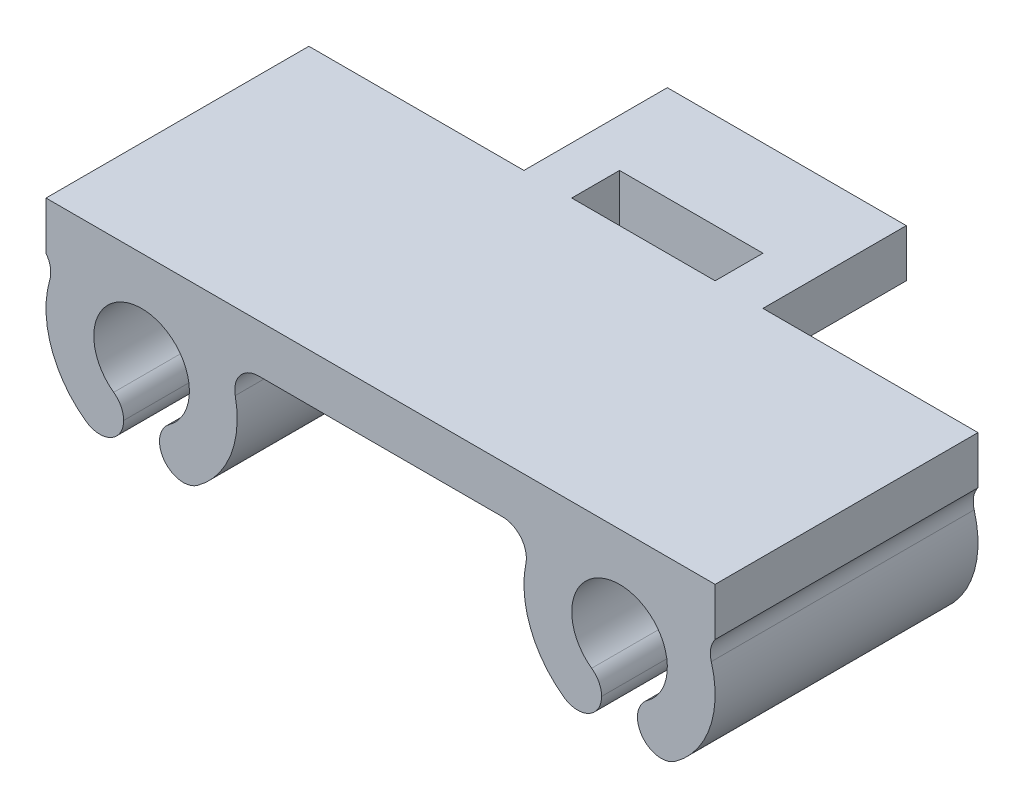
ISO-10303-21;
HEADER;
FILE_DESCRIPTION(('STEP AP214'),'2;1');
FILE_NAME('part.step','',(''),(''),'','','');
FILE_SCHEMA(('AUTOMOTIVE_DESIGN { 1 0 10303 214 1 1 1 1 }'));
ENDSEC;
DATA;
#1=APPLICATION_CONTEXT('core data for automotive mechanical design processes');
#2=APPLICATION_PROTOCOL_DEFINITION('international standard','automotive_design',2000,#1);
#3=PRODUCT_CONTEXT('',#1,'mechanical');
#4=PRODUCT('Part','Part','',(#3));
#5=PRODUCT_RELATED_PRODUCT_CATEGORY('part','',(#4));
#6=PRODUCT_DEFINITION_FORMATION('','',#4);
#7=PRODUCT_DEFINITION_CONTEXT('part definition',#1,'design');
#8=PRODUCT_DEFINITION('design','',#6,#7);
#9=PRODUCT_DEFINITION_SHAPE('','',#8);
#10=(LENGTH_UNIT() NAMED_UNIT(*) SI_UNIT(.MILLI.,.METRE.));
#11=(NAMED_UNIT(*) PLANE_ANGLE_UNIT() SI_UNIT($,.RADIAN.));
#12=(NAMED_UNIT(*) SI_UNIT($,.STERADIAN.) SOLID_ANGLE_UNIT());
#13=UNCERTAINTY_MEASURE_WITH_UNIT(LENGTH_MEASURE(1.E-05),#10,'distance_accuracy_value','');
#14=(GEOMETRIC_REPRESENTATION_CONTEXT(3) GLOBAL_UNCERTAINTY_ASSIGNED_CONTEXT((#13)) GLOBAL_UNIT_ASSIGNED_CONTEXT((#10,
#11,#12)) REPRESENTATION_CONTEXT('',''));
#15=CARTESIAN_POINT('',(0.,0.,0.));
#16=DIRECTION('',(0.,0.,1.));
#17=DIRECTION('',(1.,0.,0.));
#18=AXIS2_PLACEMENT_3D('',#15,#16,#17);
#19=CARTESIAN_POINT('',(0.,0.,0.));
#20=DIRECTION('',(0.,1.,0.));
#21=DIRECTION('',(0.,0.,1.));
#22=AXIS2_PLACEMENT_3D('',#19,#20,#21);
#23=PLANE('',#22);
#24=DIRECTION('',(1.,0.,0.));
#25=VECTOR('',#24,1.);
#26=CARTESIAN_POINT('',(0.,0.,-5.5));
#27=LINE('',#26,#25);
#28=CARTESIAN_POINT('',(-3.,0.,-5.5));
#29=VERTEX_POINT('',#28);
#30=CARTESIAN_POINT('',(3.,0.,-5.5));
#31=VERTEX_POINT('',#30);
#32=EDGE_CURVE('E240',#29,#31,#27,.T.);
#33=ORIENTED_EDGE('',*,*,#32,.T.);
#34=DIRECTION('',(0.,0.,1.));
#35=VECTOR('',#34,1.);
#36=CARTESIAN_POINT('',(3.00000000000001,0.,0.));
#37=LINE('',#36,#35);
#38=CARTESIAN_POINT('',(3.,0.,-7.5));
#39=VERTEX_POINT('',#38);
#40=EDGE_CURVE('E293',#39,#31,#37,.T.);
#41=ORIENTED_EDGE('',*,*,#40,.F.);
#42=DIRECTION('',(1.,0.,0.));
#43=VECTOR('',#42,1.);
#44=CARTESIAN_POINT('',(0.,0.,-7.5));
#45=LINE('',#44,#43);
#46=CARTESIAN_POINT('',(-3.,0.,-7.5));
#47=VERTEX_POINT('',#46);
#48=EDGE_CURVE('E291',#47,#39,#45,.T.);
#49=ORIENTED_EDGE('',*,*,#48,.F.);
#50=DIRECTION('',(0.,0.,1.));
#51=VECTOR('',#50,1.);
#52=CARTESIAN_POINT('',(-2.99999999999999,0.,0.));
#53=LINE('',#52,#51);
#54=EDGE_CURVE('E286',#47,#29,#53,.T.);
#55=ORIENTED_EDGE('',*,*,#54,.T.);
#56=EDGE_LOOP('',(#33,#41,#49,#55));
#57=FACE_BOUND('',#56,.T.);
#58=DIRECTION('',(1.,0.,0.));
#59=VECTOR('',#58,1.);
#60=CARTESIAN_POINT('',(0.,0.,5.5));
#61=LINE('',#60,#59);
#62=CARTESIAN_POINT('',(-5.10102051443364,0.,5.5));
#63=VERTEX_POINT('',#62);
#64=CARTESIAN_POINT('',(5.10102051443364,0.,5.5));
#65=VERTEX_POINT('',#64);
#66=EDGE_CURVE('E296',#63,#65,#61,.T.);
#67=ORIENTED_EDGE('',*,*,#66,.F.);
#68=DIRECTION('',(0.,0.,1.));
#69=VECTOR('',#68,1.);
#70=CARTESIAN_POINT('',(-5.10102051443364,0.,-5.5));
#71=LINE('',#70,#69);
#72=CARTESIAN_POINT('',(-5.10102051443364,0.,-5.5));
#73=VERTEX_POINT('',#72);
#74=EDGE_CURVE('E354',#63,#73,#71,.F.);
#75=ORIENTED_EDGE('',*,*,#74,.T.);
#76=CARTESIAN_POINT('',(-5.,0.,-5.5));
#77=VERTEX_POINT('',#76);
#78=EDGE_CURVE('E288',#73,#77,#27,.T.);
#79=ORIENTED_EDGE('',*,*,#78,.T.);
#80=DIRECTION('',(0.,0.,1.));
#81=VECTOR('',#80,1.);
#82=CARTESIAN_POINT('',(-5.,0.,0.));
#83=LINE('',#82,#81);
#84=CARTESIAN_POINT('',(-5.,0.,-11.5));
#85=VERTEX_POINT('',#84);
#86=EDGE_CURVE('E308',#85,#77,#83,.T.);
#87=ORIENTED_EDGE('',*,*,#86,.F.);
#88=DIRECTION('',(1.,0.,0.));
#89=VECTOR('',#88,1.);
#90=CARTESIAN_POINT('',(0.,0.,-11.5));
#91=LINE('',#90,#89);
#92=CARTESIAN_POINT('',(5.,0.,-11.5));
#93=VERTEX_POINT('',#92);
#94=EDGE_CURVE('E305',#85,#93,#91,.T.);
#95=ORIENTED_EDGE('',*,*,#94,.T.);
#96=DIRECTION('',(0.,0.,1.));
#97=VECTOR('',#96,1.);
#98=CARTESIAN_POINT('',(5.,0.,0.));
#99=LINE('',#98,#97);
#100=CARTESIAN_POINT('',(5.,0.,-5.5));
#101=VERTEX_POINT('',#100);
#102=EDGE_CURVE('E302',#93,#101,#99,.T.);
#103=ORIENTED_EDGE('',*,*,#102,.T.);
#104=CARTESIAN_POINT('',(5.10102051443364,0.,-5.5));
#105=VERTEX_POINT('',#104);
#106=EDGE_CURVE('E289',#101,#105,#27,.T.);
#107=ORIENTED_EDGE('',*,*,#106,.T.);
#108=DIRECTION('',(0.,0.,1.));
#109=VECTOR('',#108,1.);
#110=CARTESIAN_POINT('',(5.10102051443364,0.,5.5));
#111=LINE('',#110,#109);
#112=EDGE_CURVE('E352',#105,#65,#111,.T.);
#113=ORIENTED_EDGE('',*,*,#112,.T.);
#114=EDGE_LOOP('',(#67,#75,#79,#87,#95,#103,#107,#113));
#115=FACE_BOUND('',#114,.T.);
#116=ADVANCED_FACE('F38',(#57,#115),#23,.F.);
#117=CARTESIAN_POINT('',(0.,2.,5.5));
#118=DIRECTION('',(0.,0.,-1.));
#119=DIRECTION('',(-1.,0.,0.));
#120=AXIS2_PLACEMENT_3D('',#117,#118,#119);
#121=PLANE('',#120);
#122=CARTESIAN_POINT('',(11.75,-4.43669858620224,5.5));
#123=DIRECTION('',(0.,0.,-1.));
#124=DIRECTION('',(-1.,0.,0.));
#125=AXIS2_PLACEMENT_3D('',#122,#123,#124);
#126=CIRCLE('',#125,1.);
#127=CARTESIAN_POINT('',(11.1666666666667,-3.62446572413482,5.5));
#128=VERTEX_POINT('',#127);
#129=CARTESIAN_POINT('',(10.75,-4.43669858620224,5.5));
#130=VERTEX_POINT('',#129);
#131=EDGE_CURVE('E382',#128,#130,#126,.F.);
#132=ORIENTED_EDGE('',*,*,#131,.T.);
#133=CARTESIAN_POINT('',(11.75,-4.43669858620224,5.5));
#134=DIRECTION('',(0.,0.,-1.));
#135=DIRECTION('',(-1.,0.,0.));
#136=AXIS2_PLACEMENT_3D('',#133,#134,#135);
#137=CIRCLE('',#136,1.);
#138=CARTESIAN_POINT('',(12.3333333333333,-5.24893144826965,5.5));
#139=VERTEX_POINT('',#138);
#140=EDGE_CURVE('E384',#130,#139,#137,.F.);
#141=ORIENTED_EDGE('',*,*,#140,.T.);
#142=CARTESIAN_POINT('',(10.,-2.,5.5));
#143=DIRECTION('',(0.,0.,1.));
#144=DIRECTION('',(-1.,0.,0.));
#145=AXIS2_PLACEMENT_3D('',#142,#143,#144);
#146=CIRCLE('',#145,4.);
#147=CARTESIAN_POINT('',(13.84,-0.88,5.5));
#148=VERTEX_POINT('',#147);
#149=EDGE_CURVE('E449',#139,#148,#146,.T.);
#150=ORIENTED_EDGE('',*,*,#149,.T.);
#151=CARTESIAN_POINT('',(14.8,-0.600000000000001,5.5));
#152=DIRECTION('',(0.,0.,-1.));
#153=DIRECTION('',(-1.,0.,0.));
#154=AXIS2_PLACEMENT_3D('',#151,#152,#153);
#155=CIRCLE('',#154,1.);
#156=CARTESIAN_POINT('',(14.,0.,5.5));
#157=VERTEX_POINT('',#156);
#158=EDGE_CURVE('E406',#148,#157,#155,.T.);
#159=ORIENTED_EDGE('',*,*,#158,.T.);
#160=DIRECTION('',(0.,-1.,0.));
#161=VECTOR('',#160,1.);
#162=CARTESIAN_POINT('',(14.,2.,5.5));
#163=LINE('',#162,#161);
#164=CARTESIAN_POINT('',(14.,2.,5.5));
#165=VERTEX_POINT('',#164);
#166=EDGE_CURVE('E328',#165,#157,#163,.T.);
#167=ORIENTED_EDGE('',*,*,#166,.F.);
#168=DIRECTION('',(1.,0.,0.));
#169=VECTOR('',#168,1.);
#170=CARTESIAN_POINT('',(0.,2.,5.5));
#171=LINE('',#170,#169);
#172=CARTESIAN_POINT('',(-14.,2.,5.5));
#173=VERTEX_POINT('',#172);
#174=EDGE_CURVE('E267',#173,#165,#171,.T.);
#175=ORIENTED_EDGE('',*,*,#174,.F.);
#176=DIRECTION('',(0.,-1.,0.));
#177=VECTOR('',#176,1.);
#178=CARTESIAN_POINT('',(-14.,2.,5.5));
#179=LINE('',#178,#177);
#180=CARTESIAN_POINT('',(-14.,0.,5.5));
#181=VERTEX_POINT('',#180);
#182=EDGE_CURVE('E245',#173,#181,#179,.T.);
#183=ORIENTED_EDGE('',*,*,#182,.T.);
#184=CARTESIAN_POINT('',(-14.8,-0.599999999999994,5.5));
#185=DIRECTION('',(0.,0.,-1.));
#186=DIRECTION('',(-1.,0.,0.));
#187=AXIS2_PLACEMENT_3D('',#184,#185,#186);
#188=CIRCLE('',#187,1.);
#189=CARTESIAN_POINT('',(-13.84,-0.879999999999996,5.5));
#190=VERTEX_POINT('',#189);
#191=EDGE_CURVE('E404',#181,#190,#188,.T.);
#192=ORIENTED_EDGE('',*,*,#191,.T.);
#193=CARTESIAN_POINT('',(-10.,-2.,5.5));
#194=DIRECTION('',(0.,0.,1.));
#195=DIRECTION('',(1.,0.,0.));
#196=AXIS2_PLACEMENT_3D('',#193,#194,#195);
#197=CIRCLE('',#196,4.);
#198=CARTESIAN_POINT('',(-12.3333333333333,-5.24893144826965,5.5));
#199=VERTEX_POINT('',#198);
#200=EDGE_CURVE('E453',#190,#199,#197,.T.);
#201=ORIENTED_EDGE('',*,*,#200,.T.);
#202=CARTESIAN_POINT('',(-11.75,-4.43669858620224,5.5));
#203=DIRECTION('',(0.,0.,-1.));
#204=DIRECTION('',(-1.,0.,0.));
#205=AXIS2_PLACEMENT_3D('',#202,#203,#204);
#206=CIRCLE('',#205,1.);
#207=CARTESIAN_POINT('',(-10.75,-4.43669858620224,5.5));
#208=VERTEX_POINT('',#207);
#209=EDGE_CURVE('E370',#199,#208,#206,.F.);
#210=ORIENTED_EDGE('',*,*,#209,.T.);
#211=CARTESIAN_POINT('',(-11.75,-4.43669858620224,5.5));
#212=DIRECTION('',(0.,0.,-1.));
#213=DIRECTION('',(-1.,0.,0.));
#214=AXIS2_PLACEMENT_3D('',#211,#212,#213);
#215=CIRCLE('',#214,1.);
#216=CARTESIAN_POINT('',(-11.1666666666667,-3.62446572413483,5.5));
#217=VERTEX_POINT('',#216);
#218=EDGE_CURVE('E372',#208,#217,#215,.F.);
#219=ORIENTED_EDGE('',*,*,#218,.T.);
#220=CARTESIAN_POINT('',(-10.,-2.,5.5));
#221=DIRECTION('',(0.,0.,-1.));
#222=DIRECTION('',(1.,0.,0.));
#223=AXIS2_PLACEMENT_3D('',#220,#221,#222);
#224=CIRCLE('',#223,2.);
#225=CARTESIAN_POINT('',(-8.83333333333333,-3.62446572413483,5.5));
#226=VERTEX_POINT('',#225);
#227=EDGE_CURVE('E287',#217,#226,#224,.T.);
#228=ORIENTED_EDGE('',*,*,#227,.T.);
#229=CARTESIAN_POINT('',(-8.25,-4.43669858620224,5.5));
#230=DIRECTION('',(0.,0.,-1.));
#231=DIRECTION('',(-1.,0.,0.));
#232=AXIS2_PLACEMENT_3D('',#229,#230,#231);
#233=CIRCLE('',#232,1.);
#234=CARTESIAN_POINT('',(-9.25,-4.43669858620224,5.5));
#235=VERTEX_POINT('',#234);
#236=EDGE_CURVE('E376',#226,#235,#233,.F.);
#237=ORIENTED_EDGE('',*,*,#236,.T.);
#238=CARTESIAN_POINT('',(-8.25,-4.43669858620224,5.5));
#239=DIRECTION('',(0.,0.,-1.));
#240=DIRECTION('',(-1.,0.,0.));
#241=AXIS2_PLACEMENT_3D('',#238,#239,#240);
#242=CIRCLE('',#241,1.);
#243=CARTESIAN_POINT('',(-7.66666666666667,-5.24893144826966,5.5));
#244=VERTEX_POINT('',#243);
#245=EDGE_CURVE('E374',#235,#244,#242,.F.);
#246=ORIENTED_EDGE('',*,*,#245,.T.);
#247=CARTESIAN_POINT('',(-6.08081641154691,-1.2,5.5));
#248=VERTEX_POINT('',#247);
#249=EDGE_CURVE('E456',#244,#248,#197,.T.);
#250=ORIENTED_EDGE('',*,*,#249,.T.);
#251=CARTESIAN_POINT('',(-5.10102051443364,-1.,5.5));
#252=DIRECTION('',(0.,0.,-1.));
#253=DIRECTION('',(-1.,0.,0.));
#254=AXIS2_PLACEMENT_3D('',#251,#252,#253);
#255=CIRCLE('',#254,1.);
#256=EDGE_CURVE('E410',#248,#63,#255,.T.);
#257=ORIENTED_EDGE('',*,*,#256,.T.);
#258=ORIENTED_EDGE('',*,*,#66,.T.);
#259=CARTESIAN_POINT('',(5.10102051443364,-1.,5.5));
#260=DIRECTION('',(0.,0.,-1.));
#261=DIRECTION('',(-1.,0.,0.));
#262=AXIS2_PLACEMENT_3D('',#259,#260,#261);
#263=CIRCLE('',#262,1.);
#264=CARTESIAN_POINT('',(6.08081641154691,-1.2,5.5));
#265=VERTEX_POINT('',#264);
#266=EDGE_CURVE('E11',#65,#265,#263,.T.);
#267=ORIENTED_EDGE('',*,*,#266,.T.);
#268=CARTESIAN_POINT('',(7.66666666666667,-5.24893144826965,5.5));
#269=VERTEX_POINT('',#268);
#270=EDGE_CURVE('E463',#265,#269,#146,.T.);
#271=ORIENTED_EDGE('',*,*,#270,.T.);
#272=CARTESIAN_POINT('',(8.25,-4.43669858620224,5.5));
#273=DIRECTION('',(0.,0.,-1.));
#274=DIRECTION('',(-1.,0.,0.));
#275=AXIS2_PLACEMENT_3D('',#272,#273,#274);
#276=CIRCLE('',#275,1.);
#277=CARTESIAN_POINT('',(9.25,-4.43669858620224,5.5));
#278=VERTEX_POINT('',#277);
#279=EDGE_CURVE('E380',#269,#278,#276,.F.);
#280=ORIENTED_EDGE('',*,*,#279,.T.);
#281=CARTESIAN_POINT('',(8.25,-4.43669858620224,5.5));
#282=DIRECTION('',(0.,0.,-1.));
#283=DIRECTION('',(-1.,0.,0.));
#284=AXIS2_PLACEMENT_3D('',#281,#282,#283);
#285=CIRCLE('',#284,1.);
#286=CARTESIAN_POINT('',(8.83333333333333,-3.62446572413483,5.5));
#287=VERTEX_POINT('',#286);
#288=EDGE_CURVE('E378',#278,#287,#285,.F.);
#289=ORIENTED_EDGE('',*,*,#288,.T.);
#290=CARTESIAN_POINT('',(10.,-2.,5.5));
#291=DIRECTION('',(0.,0.,-1.));
#292=DIRECTION('',(-1.,0.,0.));
#293=AXIS2_PLACEMENT_3D('',#290,#291,#292);
#294=CIRCLE('',#293,2.);
#295=EDGE_CURVE('E444',#287,#128,#294,.T.);
#296=ORIENTED_EDGE('',*,*,#295,.T.);
#297=EDGE_LOOP('',(#132,#141,#150,#159,#167,#175,#183,#192,#201,#210,#219,#228,#237,#246,#250,
#257,#258,#267,#271,#280,#289,#296));
#298=FACE_BOUND('',#297,.T.);
#299=ADVANCED_FACE('F471',(#298),#121,.F.);
#300=CARTESIAN_POINT('',(14.,2.,0.));
#301=DIRECTION('',(-1.,0.,0.));
#302=DIRECTION('',(0.,0.,1.));
#303=AXIS2_PLACEMENT_3D('',#300,#301,#302);
#304=PLANE('',#303);
#305=DIRECTION('',(0.,0.,-1.));
#306=VECTOR('',#305,1.);
#307=CARTESIAN_POINT('',(14.,0.,0.));
#308=LINE('',#307,#306);
#309=CARTESIAN_POINT('',(14.,0.,-5.5));
#310=VERTEX_POINT('',#309);
#311=EDGE_CURVE('E299',#157,#310,#308,.T.);
#312=ORIENTED_EDGE('',*,*,#311,.T.);
#313=DIRECTION('',(0.,-1.,0.));
#314=VECTOR('',#313,1.);
#315=CARTESIAN_POINT('',(14.,2.,-5.5));
#316=LINE('',#315,#314);
#317=CARTESIAN_POINT('',(14.,2.,-5.5));
#318=VERTEX_POINT('',#317);
#319=EDGE_CURVE('E326',#318,#310,#316,.T.);
#320=ORIENTED_EDGE('',*,*,#319,.F.);
#321=DIRECTION('',(0.,0.,-1.));
#322=VECTOR('',#321,1.);
#323=CARTESIAN_POINT('',(14.,2.,0.));
#324=LINE('',#323,#322);
#325=EDGE_CURVE('E269',#165,#318,#324,.T.);
#326=ORIENTED_EDGE('',*,*,#325,.F.);
#327=ORIENTED_EDGE('',*,*,#166,.T.);
#328=EDGE_LOOP('',(#312,#320,#326,#327));
#329=FACE_BOUND('',#328,.T.);
#330=ADVANCED_FACE('F540',(#329),#304,.F.);
#331=CARTESIAN_POINT('',(0.,2.,-5.5));
#332=DIRECTION('',(0.,0.,-1.));
#333=DIRECTION('',(-1.,0.,0.));
#334=AXIS2_PLACEMENT_3D('',#331,#332,#333);
#335=PLANE('',#334);
#336=CARTESIAN_POINT('',(10.,-2.,-5.5));
#337=DIRECTION('',(0.,0.,1.));
#338=DIRECTION('',(-1.,0.,0.));
#339=AXIS2_PLACEMENT_3D('',#336,#337,#338);
#340=CIRCLE('',#339,4.);
#341=CARTESIAN_POINT('',(12.3333333333333,-5.24893144826965,-5.5));
#342=VERTEX_POINT('',#341);
#343=CARTESIAN_POINT('',(13.84,-0.88,-5.5));
#344=VERTEX_POINT('',#343);
#345=EDGE_CURVE('E464',#342,#344,#340,.T.);
#346=ORIENTED_EDGE('',*,*,#345,.F.);
#347=CARTESIAN_POINT('',(11.75,-4.43669858620224,-5.5));
#348=DIRECTION('',(0.,0.,-1.));
#349=DIRECTION('',(-1.,0.,0.));
#350=AXIS2_PLACEMENT_3D('',#347,#348,#349);
#351=CIRCLE('',#350,1.);
#352=CARTESIAN_POINT('',(10.75,-4.43669858620224,-5.5));
#353=VERTEX_POINT('',#352);
#354=EDGE_CURVE('E368',#342,#353,#351,.T.);
#355=ORIENTED_EDGE('',*,*,#354,.T.);
#356=CARTESIAN_POINT('',(11.75,-4.43669858620224,-5.5));
#357=DIRECTION('',(0.,0.,-1.));
#358=DIRECTION('',(-1.,0.,0.));
#359=AXIS2_PLACEMENT_3D('',#356,#357,#358);
#360=CIRCLE('',#359,1.);
#361=CARTESIAN_POINT('',(11.1666666666667,-3.62446572413482,-5.5));
#362=VERTEX_POINT('',#361);
#363=EDGE_CURVE('E366',#353,#362,#360,.T.);
#364=ORIENTED_EDGE('',*,*,#363,.T.);
#365=CARTESIAN_POINT('',(10.,-2.,-5.5));
#366=DIRECTION('',(0.,0.,-1.));
#367=DIRECTION('',(-1.,0.,0.));
#368=AXIS2_PLACEMENT_3D('',#365,#366,#367);
#369=CIRCLE('',#368,2.);
#370=CARTESIAN_POINT('',(8.83333333333333,-3.62446572413483,-5.5));
#371=VERTEX_POINT('',#370);
#372=EDGE_CURVE('E460',#371,#362,#369,.T.);
#373=ORIENTED_EDGE('',*,*,#372,.F.);
#374=CARTESIAN_POINT('',(8.25,-4.43669858620224,-5.5));
#375=DIRECTION('',(0.,0.,-1.));
#376=DIRECTION('',(-1.,0.,0.));
#377=AXIS2_PLACEMENT_3D('',#374,#375,#376);
#378=CIRCLE('',#377,1.);
#379=CARTESIAN_POINT('',(9.25,-4.43669858620224,-5.5));
#380=VERTEX_POINT('',#379);
#381=EDGE_CURVE('E362',#371,#380,#378,.T.);
#382=ORIENTED_EDGE('',*,*,#381,.T.);
#383=CARTESIAN_POINT('',(8.25,-4.43669858620224,-5.5));
#384=DIRECTION('',(0.,0.,-1.));
#385=DIRECTION('',(-1.,0.,0.));
#386=AXIS2_PLACEMENT_3D('',#383,#384,#385);
#387=CIRCLE('',#386,1.);
#388=CARTESIAN_POINT('',(7.66666666666667,-5.24893144826965,-5.5));
#389=VERTEX_POINT('',#388);
#390=EDGE_CURVE('E364',#380,#389,#387,.T.);
#391=ORIENTED_EDGE('',*,*,#390,.T.);
#392=CARTESIAN_POINT('',(6.08081641154691,-1.2,-5.5));
#393=VERTEX_POINT('',#392);
#394=EDGE_CURVE('E418',#393,#389,#340,.T.);
#395=ORIENTED_EDGE('',*,*,#394,.F.);
#396=CARTESIAN_POINT('',(5.10102051443364,-1.,-5.5));
#397=DIRECTION('',(0.,0.,-1.));
#398=DIRECTION('',(-1.,0.,0.));
#399=AXIS2_PLACEMENT_3D('',#396,#397,#398);
#400=CIRCLE('',#399,1.);
#401=EDGE_CURVE('E47',#393,#105,#400,.F.);
#402=ORIENTED_EDGE('',*,*,#401,.T.);
#403=ORIENTED_EDGE('',*,*,#106,.F.);
#404=DIRECTION('',(0.,-1.,0.));
#405=VECTOR('',#404,1.);
#406=CARTESIAN_POINT('',(5.,2.,-5.5));
#407=LINE('',#406,#405);
#408=CARTESIAN_POINT('',(5.,2.,-5.5));
#409=VERTEX_POINT('',#408);
#410=EDGE_CURVE('E324',#409,#101,#407,.T.);
#411=ORIENTED_EDGE('',*,*,#410,.F.);
#412=DIRECTION('',(1.,0.,0.));
#413=VECTOR('',#412,1.);
#414=CARTESIAN_POINT('',(0.,2.,-5.5));
#415=LINE('',#414,#413);
#416=EDGE_CURVE('E258',#409,#318,#415,.T.);
#417=ORIENTED_EDGE('',*,*,#416,.T.);
#418=ORIENTED_EDGE('',*,*,#319,.T.);
#419=CARTESIAN_POINT('',(14.8,-0.600000000000001,-5.5));
#420=DIRECTION('',(0.,0.,-1.));
#421=DIRECTION('',(-1.,0.,0.));
#422=AXIS2_PLACEMENT_3D('',#419,#420,#421);
#423=CIRCLE('',#422,1.);
#424=EDGE_CURVE('E408',#310,#344,#423,.F.);
#425=ORIENTED_EDGE('',*,*,#424,.T.);
#426=EDGE_LOOP('',(#346,#355,#364,#373,#382,#391,#395,#402,#403,#411,#417,#418,#425));
#427=FACE_BOUND('',#426,.T.);
#428=ADVANCED_FACE('F485',(#427),#335,.T.);
#429=CARTESIAN_POINT('',(5.,2.,0.));
#430=DIRECTION('',(1.,0.,0.));
#431=DIRECTION('',(0.,0.,-1.));
#432=AXIS2_PLACEMENT_3D('',#429,#430,#431);
#433=PLANE('',#432);
#434=ORIENTED_EDGE('',*,*,#102,.F.);
#435=DIRECTION('',(0.,-1.,0.));
#436=VECTOR('',#435,1.);
#437=CARTESIAN_POINT('',(5.,2.,-11.5));
#438=LINE('',#437,#436);
#439=CARTESIAN_POINT('',(5.,2.,-11.5));
#440=VERTEX_POINT('',#439);
#441=EDGE_CURVE('E322',#440,#93,#438,.T.);
#442=ORIENTED_EDGE('',*,*,#441,.F.);
#443=DIRECTION('',(0.,0.,1.));
#444=VECTOR('',#443,1.);
#445=CARTESIAN_POINT('',(5.,2.,0.));
#446=LINE('',#445,#444);
#447=EDGE_CURVE('E272',#440,#409,#446,.T.);
#448=ORIENTED_EDGE('',*,*,#447,.T.);
#449=ORIENTED_EDGE('',*,*,#410,.T.);
#450=EDGE_LOOP('',(#434,#442,#448,#449));
#451=FACE_BOUND('',#450,.T.);
#452=ADVANCED_FACE('F532',(#451),#433,.T.);
#453=CARTESIAN_POINT('',(0.,2.,-11.5));
#454=DIRECTION('',(0.,0.,-1.));
#455=DIRECTION('',(-1.,0.,0.));
#456=AXIS2_PLACEMENT_3D('',#453,#454,#455);
#457=PLANE('',#456);
#458=ORIENTED_EDGE('',*,*,#94,.F.);
#459=DIRECTION('',(0.,-1.,0.));
#460=VECTOR('',#459,1.);
#461=CARTESIAN_POINT('',(-5.,2.,-11.5));
#462=LINE('',#461,#460);
#463=CARTESIAN_POINT('',(-5.,2.,-11.5));
#464=VERTEX_POINT('',#463);
#465=EDGE_CURVE('E320',#464,#85,#462,.T.);
#466=ORIENTED_EDGE('',*,*,#465,.F.);
#467=DIRECTION('',(1.,0.,0.));
#468=VECTOR('',#467,1.);
#469=CARTESIAN_POINT('',(0.,2.,-11.5));
#470=LINE('',#469,#468);
#471=EDGE_CURVE('E275',#464,#440,#470,.T.);
#472=ORIENTED_EDGE('',*,*,#471,.T.);
#473=ORIENTED_EDGE('',*,*,#441,.T.);
#474=EDGE_LOOP('',(#458,#466,#472,#473));
#475=FACE_BOUND('',#474,.T.);
#476=ADVANCED_FACE('F529',(#475),#457,.T.);
#477=CARTESIAN_POINT('',(-5.,2.,0.));
#478=DIRECTION('',(1.,0.,0.));
#479=DIRECTION('',(0.,0.,-1.));
#480=AXIS2_PLACEMENT_3D('',#477,#478,#479);
#481=PLANE('',#480);
#482=ORIENTED_EDGE('',*,*,#86,.T.);
#483=DIRECTION('',(0.,-1.,0.));
#484=VECTOR('',#483,1.);
#485=CARTESIAN_POINT('',(-5.,2.,-5.5));
#486=LINE('',#485,#484);
#487=CARTESIAN_POINT('',(-5.,2.,-5.5));
#488=VERTEX_POINT('',#487);
#489=EDGE_CURVE('E317',#488,#77,#486,.T.);
#490=ORIENTED_EDGE('',*,*,#489,.F.);
#491=DIRECTION('',(0.,0.,1.));
#492=VECTOR('',#491,1.);
#493=CARTESIAN_POINT('',(-5.,2.,0.));
#494=LINE('',#493,#492);
#495=EDGE_CURVE('E278',#464,#488,#494,.T.);
#496=ORIENTED_EDGE('',*,*,#495,.F.);
#497=ORIENTED_EDGE('',*,*,#465,.T.);
#498=EDGE_LOOP('',(#482,#490,#496,#497));
#499=FACE_BOUND('',#498,.T.);
#500=ADVANCED_FACE('F526',(#499),#481,.F.);
#501=CARTESIAN_POINT('',(-8.25,-4.43669858620224,-5.5));
#502=DIRECTION('',(0.,0.,-1.));
#503=DIRECTION('',(-1.,0.,0.));
#504=AXIS2_PLACEMENT_3D('',#501,#502,#503);
#505=CIRCLE('',#504,1.);
#506=CARTESIAN_POINT('',(-7.66666666666667,-5.24893144826966,-5.5));
#507=VERTEX_POINT('',#506);
#508=CARTESIAN_POINT('',(-9.25,-4.43669858620224,-5.5));
#509=VERTEX_POINT('',#508);
#510=EDGE_CURVE('E393',#507,#509,#505,.T.);
#511=ORIENTED_EDGE('',*,*,#510,.T.);
#512=CARTESIAN_POINT('',(-8.25,-4.43669858620224,-5.5));
#513=DIRECTION('',(0.,0.,-1.));
#514=DIRECTION('',(-1.,0.,0.));
#515=AXIS2_PLACEMENT_3D('',#512,#513,#514);
#516=CIRCLE('',#515,1.);
#517=CARTESIAN_POINT('',(-8.83333333333333,-3.62446572413483,-5.5));
#518=VERTEX_POINT('',#517);
#519=EDGE_CURVE('E61',#509,#518,#516,.T.);
#520=ORIENTED_EDGE('',*,*,#519,.T.);
#521=CARTESIAN_POINT('',(-10.,-2.,-5.5));
#522=DIRECTION('',(0.,0.,-1.));
#523=DIRECTION('',(1.,0.,0.));
#524=AXIS2_PLACEMENT_3D('',#521,#522,#523);
#525=CIRCLE('',#524,2.);
#526=CARTESIAN_POINT('',(-11.1666666666667,-3.62446572413483,-5.5));
#527=VERTEX_POINT('',#526);
#528=EDGE_CURVE('E447',#527,#518,#525,.T.);
#529=ORIENTED_EDGE('',*,*,#528,.F.);
#530=CARTESIAN_POINT('',(-11.75,-4.43669858620224,-5.5));
#531=DIRECTION('',(0.,0.,-1.));
#532=DIRECTION('',(-1.,0.,0.));
#533=AXIS2_PLACEMENT_3D('',#530,#531,#532);
#534=CIRCLE('',#533,1.);
#535=CARTESIAN_POINT('',(-10.75,-4.43669858620224,-5.5));
#536=VERTEX_POINT('',#535);
#537=EDGE_CURVE('E55',#527,#536,#534,.T.);
#538=ORIENTED_EDGE('',*,*,#537,.T.);
#539=CARTESIAN_POINT('',(-11.75,-4.43669858620224,-5.5));
#540=DIRECTION('',(0.,0.,-1.));
#541=DIRECTION('',(-1.,0.,0.));
#542=AXIS2_PLACEMENT_3D('',#539,#540,#541);
#543=CIRCLE('',#542,1.);
#544=CARTESIAN_POINT('',(-12.3333333333333,-5.24893144826965,-5.5));
#545=VERTEX_POINT('',#544);
#546=EDGE_CURVE('E390',#536,#545,#543,.T.);
#547=ORIENTED_EDGE('',*,*,#546,.T.);
#548=CARTESIAN_POINT('',(-10.,-2.,-5.5));
#549=DIRECTION('',(0.,0.,1.));
#550=DIRECTION('',(1.,0.,0.));
#551=AXIS2_PLACEMENT_3D('',#548,#549,#550);
#552=CIRCLE('',#551,4.);
#553=CARTESIAN_POINT('',(-13.84,-0.879999999999996,-5.5));
#554=VERTEX_POINT('',#553);
#555=EDGE_CURVE('E437',#554,#545,#552,.T.);
#556=ORIENTED_EDGE('',*,*,#555,.F.);
#557=CARTESIAN_POINT('',(-14.8,-0.599999999999994,-5.5));
#558=DIRECTION('',(0.,0.,-1.));
#559=DIRECTION('',(-1.,0.,0.));
#560=AXIS2_PLACEMENT_3D('',#557,#558,#559);
#561=CIRCLE('',#560,1.);
#562=CARTESIAN_POINT('',(-14.,0.,-5.5));
#563=VERTEX_POINT('',#562);
#564=EDGE_CURVE('E402',#554,#563,#561,.F.);
#565=ORIENTED_EDGE('',*,*,#564,.T.);
#566=DIRECTION('',(0.,-1.,0.));
#567=VECTOR('',#566,1.);
#568=CARTESIAN_POINT('',(-14.,2.,-5.5));
#569=LINE('',#568,#567);
#570=CARTESIAN_POINT('',(-14.,2.,-5.5));
#571=VERTEX_POINT('',#570);
#572=EDGE_CURVE('E314',#571,#563,#569,.T.);
#573=ORIENTED_EDGE('',*,*,#572,.F.);
#574=EDGE_CURVE('E257',#571,#488,#415,.T.);
#575=ORIENTED_EDGE('',*,*,#574,.T.);
#576=ORIENTED_EDGE('',*,*,#489,.T.);
#577=ORIENTED_EDGE('',*,*,#78,.F.);
#578=CARTESIAN_POINT('',(-5.10102051443364,-1.,-5.5));
#579=DIRECTION('',(0.,0.,-1.));
#580=DIRECTION('',(-1.,0.,0.));
#581=AXIS2_PLACEMENT_3D('',#578,#579,#580);
#582=CIRCLE('',#581,1.);
#583=CARTESIAN_POINT('',(-6.08081641154691,-1.2,-5.5));
#584=VERTEX_POINT('',#583);
#585=EDGE_CURVE('E412',#73,#584,#582,.F.);
#586=ORIENTED_EDGE('',*,*,#585,.T.);
#587=EDGE_CURVE('E443',#507,#584,#552,.T.);
#588=ORIENTED_EDGE('',*,*,#587,.F.);
#589=EDGE_LOOP('',(#511,#520,#529,#538,#547,#556,#565,#573,#575,#576,#577,#586,#588));
#590=FACE_BOUND('',#589,.T.);
#591=ADVANCED_FACE('F436',(#590),#335,.T.);
#592=ORIENTED_EDGE('',*,*,#32,.F.);
#593=DIRECTION('',(0.,-1.,0.));
#594=VECTOR('',#593,1.);
#595=CARTESIAN_POINT('',(-3.,2.,-5.5));
#596=LINE('',#595,#594);
#597=CARTESIAN_POINT('',(-3.,2.,-5.5));
#598=VERTEX_POINT('',#597);
#599=EDGE_CURVE('E235',#598,#29,#596,.T.);
#600=ORIENTED_EDGE('',*,*,#599,.F.);
#601=CARTESIAN_POINT('',(3.,2.,-5.5));
#602=VERTEX_POINT('',#601);
#603=EDGE_CURVE('E238',#598,#602,#415,.T.);
#604=ORIENTED_EDGE('',*,*,#603,.T.);
#605=DIRECTION('',(0.,-1.,0.));
#606=VECTOR('',#605,1.);
#607=CARTESIAN_POINT('',(3.,2.,-5.5));
#608=LINE('',#607,#606);
#609=EDGE_CURVE('E284',#602,#31,#608,.T.);
#610=ORIENTED_EDGE('',*,*,#609,.T.);
#611=EDGE_LOOP('',(#592,#600,#604,#610));
#612=FACE_BOUND('',#611,.T.);
#613=ADVANCED_FACE('F237',(#612),#335,.T.);
#614=CARTESIAN_POINT('',(-2.99999999999999,2.,0.));
#615=DIRECTION('',(1.,0.,0.));
#616=DIRECTION('',(0.,0.,-1.));
#617=AXIS2_PLACEMENT_3D('',#614,#615,#616);
#618=PLANE('',#617);
#619=ORIENTED_EDGE('',*,*,#54,.F.);
#620=DIRECTION('',(0.,-1.,0.));
#621=VECTOR('',#620,1.);
#622=CARTESIAN_POINT('',(-3.,2.,-7.5));
#623=LINE('',#622,#621);
#624=CARTESIAN_POINT('',(-3.,2.,-7.5));
#625=VERTEX_POINT('',#624);
#626=EDGE_CURVE('E246',#625,#47,#623,.T.);
#627=ORIENTED_EDGE('',*,*,#626,.F.);
#628=DIRECTION('',(0.,0.,1.));
#629=VECTOR('',#628,1.);
#630=CARTESIAN_POINT('',(-2.99999999999999,2.,0.));
#631=LINE('',#630,#629);
#632=EDGE_CURVE('E251',#625,#598,#631,.T.);
#633=ORIENTED_EDGE('',*,*,#632,.T.);
#634=ORIENTED_EDGE('',*,*,#599,.T.);
#635=EDGE_LOOP('',(#619,#627,#633,#634));
#636=FACE_BOUND('',#635,.T.);
#637=ADVANCED_FACE('F259',(#636),#618,.T.);
#638=CARTESIAN_POINT('',(0.,2.,-7.5));
#639=DIRECTION('',(0.,0.,-1.));
#640=DIRECTION('',(-1.,0.,0.));
#641=AXIS2_PLACEMENT_3D('',#638,#639,#640);
#642=PLANE('',#641);
#643=ORIENTED_EDGE('',*,*,#48,.T.);
#644=DIRECTION('',(0.,-1.,0.));
#645=VECTOR('',#644,1.);
#646=CARTESIAN_POINT('',(3.,2.,-7.5));
#647=LINE('',#646,#645);
#648=CARTESIAN_POINT('',(3.,2.,-7.5));
#649=VERTEX_POINT('',#648);
#650=EDGE_CURVE('E333',#649,#39,#647,.T.);
#651=ORIENTED_EDGE('',*,*,#650,.F.);
#652=DIRECTION('',(1.,0.,0.));
#653=VECTOR('',#652,1.);
#654=CARTESIAN_POINT('',(0.,2.,-7.5));
#655=LINE('',#654,#653);
#656=EDGE_CURVE('E261',#625,#649,#655,.T.);
#657=ORIENTED_EDGE('',*,*,#656,.F.);
#658=ORIENTED_EDGE('',*,*,#626,.T.);
#659=EDGE_LOOP('',(#643,#651,#657,#658));
#660=FACE_BOUND('',#659,.T.);
#661=ADVANCED_FACE('F584',(#660),#642,.F.);
#662=CARTESIAN_POINT('',(3.00000000000001,2.,0.));
#663=DIRECTION('',(1.,0.,0.));
#664=DIRECTION('',(0.,0.,-1.));
#665=AXIS2_PLACEMENT_3D('',#662,#663,#664);
#666=PLANE('',#665);
#667=ORIENTED_EDGE('',*,*,#40,.T.);
#668=ORIENTED_EDGE('',*,*,#609,.F.);
#669=DIRECTION('',(0.,0.,1.));
#670=VECTOR('',#669,1.);
#671=CARTESIAN_POINT('',(3.00000000000001,2.,0.));
#672=LINE('',#671,#670);
#673=EDGE_CURVE('E253',#649,#602,#672,.T.);
#674=ORIENTED_EDGE('',*,*,#673,.F.);
#675=ORIENTED_EDGE('',*,*,#650,.T.);
#676=EDGE_LOOP('',(#667,#668,#674,#675));
#677=FACE_BOUND('',#676,.T.);
#678=ADVANCED_FACE('F570',(#677),#666,.F.);
#679=CARTESIAN_POINT('',(-14.,2.,0.));
#680=DIRECTION('',(-1.,0.,0.));
#681=DIRECTION('',(0.,0.,1.));
#682=AXIS2_PLACEMENT_3D('',#679,#680,#681);
#683=PLANE('',#682);
#684=DIRECTION('',(0.,0.,-1.));
#685=VECTOR('',#684,1.);
#686=CARTESIAN_POINT('',(-14.,0.,0.));
#687=LINE('',#686,#685);
#688=EDGE_CURVE('E255',#181,#563,#687,.T.);
#689=ORIENTED_EDGE('',*,*,#688,.F.);
#690=ORIENTED_EDGE('',*,*,#182,.F.);
#691=DIRECTION('',(0.,0.,-1.));
#692=VECTOR('',#691,1.);
#693=CARTESIAN_POINT('',(-14.,2.,0.));
#694=LINE('',#693,#692);
#695=EDGE_CURVE('E281',#173,#571,#694,.T.);
#696=ORIENTED_EDGE('',*,*,#695,.T.);
#697=ORIENTED_EDGE('',*,*,#572,.T.);
#698=EDGE_LOOP('',(#689,#690,#696,#697));
#699=FACE_BOUND('',#698,.T.);
#700=ADVANCED_FACE('F567',(#699),#683,.T.);
#701=CARTESIAN_POINT('',(0.,2.,0.));
#702=DIRECTION('',(0.,1.,0.));
#703=DIRECTION('',(0.,0.,1.));
#704=AXIS2_PLACEMENT_3D('',#701,#702,#703);
#705=PLANE('',#704);
#706=ORIENTED_EDGE('',*,*,#174,.T.);
#707=ORIENTED_EDGE('',*,*,#325,.T.);
#708=ORIENTED_EDGE('',*,*,#416,.F.);
#709=ORIENTED_EDGE('',*,*,#447,.F.);
#710=ORIENTED_EDGE('',*,*,#471,.F.);
#711=ORIENTED_EDGE('',*,*,#495,.T.);
#712=ORIENTED_EDGE('',*,*,#574,.F.);
#713=ORIENTED_EDGE('',*,*,#695,.F.);
#714=EDGE_LOOP('',(#706,#707,#708,#709,#710,#711,#712,#713));
#715=FACE_BOUND('',#714,.T.);
#716=ORIENTED_EDGE('',*,*,#603,.F.);
#717=ORIENTED_EDGE('',*,*,#632,.F.);
#718=ORIENTED_EDGE('',*,*,#656,.T.);
#719=ORIENTED_EDGE('',*,*,#673,.T.);
#720=EDGE_LOOP('',(#716,#717,#718,#719));
#721=FACE_BOUND('',#720,.T.);
#722=ADVANCED_FACE('F250',(#715,#721),#705,.T.);
#723=CARTESIAN_POINT('',(-10.,-2.,5.5));
#724=DIRECTION('',(0.,0.,-1.));
#725=DIRECTION('',(-1.,0.,0.));
#726=AXIS2_PLACEMENT_3D('',#723,#724,#725);
#727=CYLINDRICAL_SURFACE('',#726,4.);
#728=ORIENTED_EDGE('',*,*,#587,.T.);
#729=DIRECTION('',(0.,0.,-1.));
#730=VECTOR('',#729,1.);
#731=CARTESIAN_POINT('',(-6.08081641154691,-1.2,5.5));
#732=LINE('',#731,#730);
#733=EDGE_CURVE('E349',#584,#248,#732,.F.);
#734=ORIENTED_EDGE('',*,*,#733,.T.);
#735=ORIENTED_EDGE('',*,*,#249,.F.);
#736=DIRECTION('',(0.,0.,-1.));
#737=VECTOR('',#736,1.);
#738=CARTESIAN_POINT('',(-7.66666666666667,-5.24893144826966,5.5));
#739=LINE('',#738,#737);
#740=EDGE_CURVE('E347',#244,#507,#739,.T.);
#741=ORIENTED_EDGE('',*,*,#740,.T.);
#742=EDGE_LOOP('',(#728,#734,#735,#741));
#743=FACE_BOUND('',#742,.T.);
#744=ADVANCED_FACE('F632',(#743),#727,.T.);
#745=ORIENTED_EDGE('',*,*,#200,.F.);
#746=DIRECTION('',(0.,0.,-1.));
#747=VECTOR('',#746,1.);
#748=CARTESIAN_POINT('',(-13.84,-0.879999999999996,5.5));
#749=LINE('',#748,#747);
#750=EDGE_CURVE('E338',#190,#554,#749,.T.);
#751=ORIENTED_EDGE('',*,*,#750,.T.);
#752=ORIENTED_EDGE('',*,*,#555,.T.);
#753=DIRECTION('',(0.,0.,-1.));
#754=VECTOR('',#753,1.);
#755=CARTESIAN_POINT('',(-12.3333333333333,-5.24893144826965,5.5));
#756=LINE('',#755,#754);
#757=EDGE_CURVE('E331',#545,#199,#756,.F.);
#758=ORIENTED_EDGE('',*,*,#757,.T.);
#759=EDGE_LOOP('',(#745,#751,#752,#758));
#760=FACE_BOUND('',#759,.T.);
#761=ADVANCED_FACE('F440',(#760),#727,.T.);
#762=CARTESIAN_POINT('',(-10.,-2.,5.5));
#763=DIRECTION('',(0.,0.,-1.));
#764=DIRECTION('',(-1.,0.,0.));
#765=AXIS2_PLACEMENT_3D('',#762,#763,#764);
#766=CYLINDRICAL_SURFACE('',#765,2.);
#767=ORIENTED_EDGE('',*,*,#528,.T.);
#768=DIRECTION('',(0.,0.,-1.));
#769=VECTOR('',#768,1.);
#770=CARTESIAN_POINT('',(-8.83333333333333,-3.62446572413483,5.5));
#771=LINE('',#770,#769);
#772=EDGE_CURVE('E399',#518,#226,#771,.F.);
#773=ORIENTED_EDGE('',*,*,#772,.T.);
#774=ORIENTED_EDGE('',*,*,#227,.F.);
#775=DIRECTION('',(0.,0.,-1.));
#776=VECTOR('',#775,1.);
#777=CARTESIAN_POINT('',(-11.1666666666667,-3.62446572413483,5.5));
#778=LINE('',#777,#776);
#779=EDGE_CURVE('E396',#217,#527,#778,.T.);
#780=ORIENTED_EDGE('',*,*,#779,.T.);
#781=EDGE_LOOP('',(#767,#773,#774,#780));
#782=FACE_BOUND('',#781,.T.);
#783=ADVANCED_FACE('F644',(#782),#766,.F.);
#784=CARTESIAN_POINT('',(10.,-2.,5.5));
#785=DIRECTION('',(0.,0.,-1.));
#786=DIRECTION('',(-1.,0.,0.));
#787=AXIS2_PLACEMENT_3D('',#784,#785,#786);
#788=CYLINDRICAL_SURFACE('',#787,2.);
#789=ORIENTED_EDGE('',*,*,#372,.T.);
#790=DIRECTION('',(0.,0.,-1.));
#791=VECTOR('',#790,1.);
#792=CARTESIAN_POINT('',(11.1666666666667,-3.62446572413482,5.5));
#793=LINE('',#792,#791);
#794=EDGE_CURVE('E388',#362,#128,#793,.F.);
#795=ORIENTED_EDGE('',*,*,#794,.T.);
#796=ORIENTED_EDGE('',*,*,#295,.F.);
#797=DIRECTION('',(0.,0.,-1.));
#798=VECTOR('',#797,1.);
#799=CARTESIAN_POINT('',(8.83333333333333,-3.62446572413483,5.5));
#800=LINE('',#799,#798);
#801=EDGE_CURVE('E386',#287,#371,#800,.T.);
#802=ORIENTED_EDGE('',*,*,#801,.T.);
#803=EDGE_LOOP('',(#789,#795,#796,#802));
#804=FACE_BOUND('',#803,.T.);
#805=ADVANCED_FACE('F493',(#804),#788,.F.);
#806=CARTESIAN_POINT('',(10.,-2.,5.5));
#807=DIRECTION('',(0.,0.,-1.));
#808=DIRECTION('',(-1.,0.,0.));
#809=AXIS2_PLACEMENT_3D('',#806,#807,#808);
#810=CYLINDRICAL_SURFACE('',#809,4.);
#811=ORIENTED_EDGE('',*,*,#345,.T.);
#812=DIRECTION('',(0.,0.,-1.));
#813=VECTOR('',#812,1.);
#814=CARTESIAN_POINT('',(13.84,-0.88,5.5));
#815=LINE('',#814,#813);
#816=EDGE_CURVE('E344',#344,#148,#815,.F.);
#817=ORIENTED_EDGE('',*,*,#816,.T.);
#818=ORIENTED_EDGE('',*,*,#149,.F.);
#819=DIRECTION('',(0.,0.,-1.));
#820=VECTOR('',#819,1.);
#821=CARTESIAN_POINT('',(12.3333333333333,-5.24893144826965,5.5));
#822=LINE('',#821,#820);
#823=EDGE_CURVE('E341',#139,#342,#822,.T.);
#824=ORIENTED_EDGE('',*,*,#823,.T.);
#825=EDGE_LOOP('',(#811,#817,#818,#824));
#826=FACE_BOUND('',#825,.T.);
#827=ADVANCED_FACE('F477',(#826),#810,.T.);
#828=ORIENTED_EDGE('',*,*,#270,.F.);
#829=DIRECTION('',(0.,0.,-1.));
#830=VECTOR('',#829,1.);
#831=CARTESIAN_POINT('',(6.08081641154691,-1.2,5.5));
#832=LINE('',#831,#830);
#833=EDGE_CURVE('E359',#265,#393,#832,.T.);
#834=ORIENTED_EDGE('',*,*,#833,.T.);
#835=ORIENTED_EDGE('',*,*,#394,.T.);
#836=DIRECTION('',(0.,0.,-1.));
#837=VECTOR('',#836,1.);
#838=CARTESIAN_POINT('',(7.66666666666667,-5.24893144826965,5.5));
#839=LINE('',#838,#837);
#840=EDGE_CURVE('E356',#389,#269,#839,.F.);
#841=ORIENTED_EDGE('',*,*,#840,.T.);
#842=EDGE_LOOP('',(#828,#834,#835,#841));
#843=FACE_BOUND('',#842,.T.);
#844=ADVANCED_FACE('F506',(#843),#810,.T.);
#845=CARTESIAN_POINT('',(-14.8,-0.599999999999994,0.));
#846=DIRECTION('',(0.,0.,1.));
#847=DIRECTION('',(1.,0.,0.));
#848=AXIS2_PLACEMENT_3D('',#845,#846,#847);
#849=CYLINDRICAL_SURFACE('',#848,1.);
#850=ORIENTED_EDGE('',*,*,#191,.F.);
#851=ORIENTED_EDGE('',*,*,#688,.T.);
#852=ORIENTED_EDGE('',*,*,#564,.F.);
#853=ORIENTED_EDGE('',*,*,#750,.F.);
#854=EDGE_LOOP('',(#850,#851,#852,#853));
#855=FACE_BOUND('',#854,.T.);
#856=ADVANCED_FACE('F547',(#855),#849,.F.);
#857=CARTESIAN_POINT('',(14.8,-0.600000000000001,0.));
#858=DIRECTION('',(0.,0.,-1.));
#859=DIRECTION('',(-1.,0.,0.));
#860=AXIS2_PLACEMENT_3D('',#857,#858,#859);
#861=CYLINDRICAL_SURFACE('',#860,1.);
#862=ORIENTED_EDGE('',*,*,#424,.F.);
#863=ORIENTED_EDGE('',*,*,#311,.F.);
#864=ORIENTED_EDGE('',*,*,#158,.F.);
#865=ORIENTED_EDGE('',*,*,#816,.F.);
#866=EDGE_LOOP('',(#862,#863,#864,#865));
#867=FACE_BOUND('',#866,.T.);
#868=ADVANCED_FACE('F544',(#867),#861,.F.);
#869=CARTESIAN_POINT('',(-5.10102051443364,-1.,5.5));
#870=DIRECTION('',(0.,0.,-1.));
#871=DIRECTION('',(-1.,0.,0.));
#872=AXIS2_PLACEMENT_3D('',#869,#870,#871);
#873=CYLINDRICAL_SURFACE('',#872,1.);
#874=ORIENTED_EDGE('',*,*,#585,.F.);
#875=ORIENTED_EDGE('',*,*,#74,.F.);
#876=ORIENTED_EDGE('',*,*,#256,.F.);
#877=ORIENTED_EDGE('',*,*,#733,.F.);
#878=EDGE_LOOP('',(#874,#875,#876,#877));
#879=FACE_BOUND('',#878,.T.);
#880=ADVANCED_FACE('F546',(#879),#873,.F.);
#881=CARTESIAN_POINT('',(5.10102051443364,-1.,5.5));
#882=DIRECTION('',(0.,0.,-1.));
#883=DIRECTION('',(-1.,0.,0.));
#884=AXIS2_PLACEMENT_3D('',#881,#882,#883);
#885=CYLINDRICAL_SURFACE('',#884,1.);
#886=ORIENTED_EDGE('',*,*,#266,.F.);
#887=ORIENTED_EDGE('',*,*,#112,.F.);
#888=ORIENTED_EDGE('',*,*,#401,.F.);
#889=ORIENTED_EDGE('',*,*,#833,.F.);
#890=EDGE_LOOP('',(#886,#887,#888,#889));
#891=FACE_BOUND('',#890,.T.);
#892=ADVANCED_FACE('F510',(#891),#885,.F.);
#893=CARTESIAN_POINT('',(11.75,-4.43669858620224,5.5));
#894=DIRECTION('',(0.,0.,-1.));
#895=DIRECTION('',(-1.,0.,0.));
#896=AXIS2_PLACEMENT_3D('',#893,#894,#895);
#897=CYLINDRICAL_SURFACE('',#896,1.);
#898=DIRECTION('',(0.,0.,-1.));
#899=VECTOR('',#898,1.);
#900=CARTESIAN_POINT('',(10.75,-4.43669858620224,5.5));
#901=LINE('',#900,#899);
#902=EDGE_CURVE('E415',#130,#353,#901,.T.);
#903=ORIENTED_EDGE('',*,*,#902,.F.);
#904=ORIENTED_EDGE('',*,*,#131,.F.);
#905=ORIENTED_EDGE('',*,*,#794,.F.);
#906=ORIENTED_EDGE('',*,*,#363,.F.);
#907=EDGE_LOOP('',(#903,#904,#905,#906));
#908=FACE_BOUND('',#907,.T.);
#909=ADVANCED_FACE('F489',(#908),#897,.T.);
#910=CARTESIAN_POINT('',(11.75,-4.43669858620224,5.5));
#911=DIRECTION('',(0.,0.,-1.));
#912=DIRECTION('',(-1.,0.,0.));
#913=AXIS2_PLACEMENT_3D('',#910,#911,#912);
#914=CYLINDRICAL_SURFACE('',#913,1.);
#915=ORIENTED_EDGE('',*,*,#140,.F.);
#916=ORIENTED_EDGE('',*,*,#902,.T.);
#917=ORIENTED_EDGE('',*,*,#354,.F.);
#918=ORIENTED_EDGE('',*,*,#823,.F.);
#919=EDGE_LOOP('',(#915,#916,#917,#918));
#920=FACE_BOUND('',#919,.T.);
#921=ADVANCED_FACE('F481',(#920),#914,.T.);
#922=CARTESIAN_POINT('',(8.25,-4.43669858620224,5.5));
#923=DIRECTION('',(0.,0.,-1.));
#924=DIRECTION('',(-1.,0.,0.));
#925=AXIS2_PLACEMENT_3D('',#922,#923,#924);
#926=CYLINDRICAL_SURFACE('',#925,1.);
#927=ORIENTED_EDGE('',*,*,#801,.F.);
#928=ORIENTED_EDGE('',*,*,#288,.F.);
#929=DIRECTION('',(0.,0.,-1.));
#930=VECTOR('',#929,1.);
#931=CARTESIAN_POINT('',(9.25,-4.43669858620224,5.5));
#932=LINE('',#931,#930);
#933=EDGE_CURVE('E419',#380,#278,#932,.F.);
#934=ORIENTED_EDGE('',*,*,#933,.F.);
#935=ORIENTED_EDGE('',*,*,#381,.F.);
#936=EDGE_LOOP('',(#927,#928,#934,#935));
#937=FACE_BOUND('',#936,.T.);
#938=ADVANCED_FACE('F498',(#937),#926,.T.);
#939=CARTESIAN_POINT('',(8.25,-4.43669858620224,5.5));
#940=DIRECTION('',(0.,0.,-1.));
#941=DIRECTION('',(-1.,0.,0.));
#942=AXIS2_PLACEMENT_3D('',#939,#940,#941);
#943=CYLINDRICAL_SURFACE('',#942,1.);
#944=ORIENTED_EDGE('',*,*,#279,.F.);
#945=ORIENTED_EDGE('',*,*,#840,.F.);
#946=ORIENTED_EDGE('',*,*,#390,.F.);
#947=ORIENTED_EDGE('',*,*,#933,.T.);
#948=EDGE_LOOP('',(#944,#945,#946,#947));
#949=FACE_BOUND('',#948,.T.);
#950=ADVANCED_FACE('F502',(#949),#943,.T.);
#951=CARTESIAN_POINT('',(-8.25,-4.43669858620224,5.5));
#952=DIRECTION('',(0.,0.,-1.));
#953=DIRECTION('',(-1.,0.,0.));
#954=AXIS2_PLACEMENT_3D('',#951,#952,#953);
#955=CYLINDRICAL_SURFACE('',#954,1.);
#956=ORIENTED_EDGE('',*,*,#740,.F.);
#957=ORIENTED_EDGE('',*,*,#245,.F.);
#958=DIRECTION('',(0.,0.,-1.));
#959=VECTOR('',#958,1.);
#960=CARTESIAN_POINT('',(-9.25,-4.43669858620224,5.5));
#961=LINE('',#960,#959);
#962=EDGE_CURVE('E421',#509,#235,#961,.F.);
#963=ORIENTED_EDGE('',*,*,#962,.F.);
#964=ORIENTED_EDGE('',*,*,#510,.F.);
#965=EDGE_LOOP('',(#956,#957,#963,#964));
#966=FACE_BOUND('',#965,.T.);
#967=ADVANCED_FACE('F731',(#966),#955,.T.);
#968=CARTESIAN_POINT('',(-8.25,-4.43669858620224,5.5));
#969=DIRECTION('',(0.,0.,-1.));
#970=DIRECTION('',(-1.,0.,0.));
#971=AXIS2_PLACEMENT_3D('',#968,#969,#970);
#972=CYLINDRICAL_SURFACE('',#971,1.);
#973=ORIENTED_EDGE('',*,*,#236,.F.);
#974=ORIENTED_EDGE('',*,*,#772,.F.);
#975=ORIENTED_EDGE('',*,*,#519,.F.);
#976=ORIENTED_EDGE('',*,*,#962,.T.);
#977=EDGE_LOOP('',(#973,#974,#975,#976));
#978=FACE_BOUND('',#977,.T.);
#979=ADVANCED_FACE('F740',(#978),#972,.T.);
#980=CARTESIAN_POINT('',(-11.75,-4.43669858620224,5.5));
#981=DIRECTION('',(0.,0.,-1.));
#982=DIRECTION('',(-1.,0.,0.));
#983=AXIS2_PLACEMENT_3D('',#980,#981,#982);
#984=CYLINDRICAL_SURFACE('',#983,1.);
#985=DIRECTION('',(0.,0.,-1.));
#986=VECTOR('',#985,1.);
#987=CARTESIAN_POINT('',(-10.75,-4.43669858620224,5.5));
#988=LINE('',#987,#986);
#989=EDGE_CURVE('E42',#208,#536,#988,.T.);
#990=ORIENTED_EDGE('',*,*,#989,.F.);
#991=ORIENTED_EDGE('',*,*,#209,.F.);
#992=ORIENTED_EDGE('',*,*,#757,.F.);
#993=ORIENTED_EDGE('',*,*,#546,.F.);
#994=EDGE_LOOP('',(#990,#991,#992,#993));
#995=FACE_BOUND('',#994,.T.);
#996=ADVANCED_FACE('F40',(#995),#984,.T.);
#997=CARTESIAN_POINT('',(-11.75,-4.43669858620224,5.5));
#998=DIRECTION('',(0.,0.,-1.));
#999=DIRECTION('',(-1.,0.,0.));
#1000=AXIS2_PLACEMENT_3D('',#997,#998,#999);
#1001=CYLINDRICAL_SURFACE('',#1000,1.);
#1002=ORIENTED_EDGE('',*,*,#218,.F.);
#1003=ORIENTED_EDGE('',*,*,#989,.T.);
#1004=ORIENTED_EDGE('',*,*,#537,.F.);
#1005=ORIENTED_EDGE('',*,*,#779,.F.);
#1006=EDGE_LOOP('',(#1002,#1003,#1004,#1005));
#1007=FACE_BOUND('',#1006,.T.);
#1008=ADVANCED_FACE('F429',(#1007),#1001,.T.);
#1009=CLOSED_SHELL('',(#116,#299,#330,#428,#452,#476,#500,#591,#613,#637,#661,#678,#700,#722,
#744,#761,#783,#805,#827,#844,#856,#868,#880,#892,#909,#921,#938,#950,#967,#979,#996,#1008));
#1010=MANIFOLD_SOLID_BREP('B2',#1009);
#1011=ADVANCED_BREP_SHAPE_REPRESENTATION('',(#18,#1010),#14);
#1012=SHAPE_DEFINITION_REPRESENTATION(#9,#1011);
ENDSEC;
END-ISO-10303-21;
